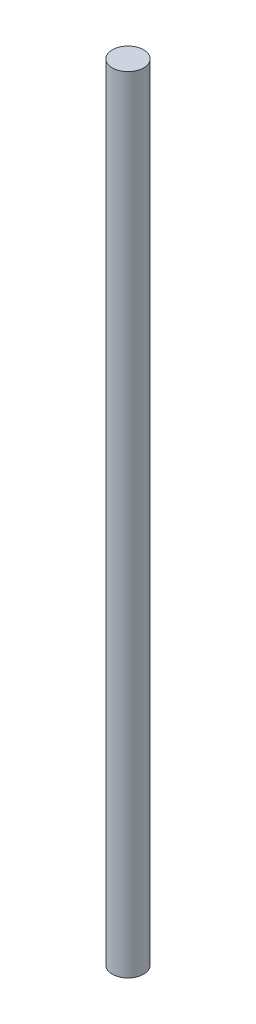
ISO-10303-21;
HEADER;
FILE_DESCRIPTION(('STEP AP214'),'2;1');
FILE_NAME('part.step','',(''),(''),'','','');
FILE_SCHEMA(('AUTOMOTIVE_DESIGN { 1 0 10303 214 1 1 1 1 }'));
ENDSEC;
DATA;
#1=APPLICATION_CONTEXT('core data for automotive mechanical design processes');
#2=APPLICATION_PROTOCOL_DEFINITION('international standard','automotive_design',2000,#1);
#3=PRODUCT_CONTEXT('',#1,'mechanical');
#4=PRODUCT('Part','Part','',(#3));
#5=PRODUCT_RELATED_PRODUCT_CATEGORY('part','',(#4));
#6=PRODUCT_DEFINITION_FORMATION('','',#4);
#7=PRODUCT_DEFINITION_CONTEXT('part definition',#1,'design');
#8=PRODUCT_DEFINITION('design','',#6,#7);
#9=PRODUCT_DEFINITION_SHAPE('','',#8);
#10=(LENGTH_UNIT() NAMED_UNIT(*) SI_UNIT(.MILLI.,.METRE.));
#11=(NAMED_UNIT(*) PLANE_ANGLE_UNIT() SI_UNIT($,.RADIAN.));
#12=(NAMED_UNIT(*) SI_UNIT($,.STERADIAN.) SOLID_ANGLE_UNIT());
#13=UNCERTAINTY_MEASURE_WITH_UNIT(LENGTH_MEASURE(1.E-05),#10,'distance_accuracy_value','');
#14=(GEOMETRIC_REPRESENTATION_CONTEXT(3) GLOBAL_UNCERTAINTY_ASSIGNED_CONTEXT((#13)) GLOBAL_UNIT_ASSIGNED_CONTEXT((#10,
#11,#12)) REPRESENTATION_CONTEXT('',''));
#15=CARTESIAN_POINT('',(0.,0.,0.));
#16=DIRECTION('',(0.,0.,1.));
#17=DIRECTION('',(1.,0.,0.));
#18=AXIS2_PLACEMENT_3D('',#15,#16,#17);
#19=CARTESIAN_POINT('',(0.,200.,0.));
#20=DIRECTION('',(0.,-1.,0.));
#21=DIRECTION('',(0.,0.,-1.));
#22=AXIS2_PLACEMENT_3D('',#19,#20,#21);
#23=CYLINDRICAL_SURFACE('',#22,4.);
#24=CARTESIAN_POINT('',(0.,200.,0.));
#25=DIRECTION('',(0.,1.,0.));
#26=DIRECTION('',(0.,0.,1.));
#27=AXIS2_PLACEMENT_3D('',#24,#25,#26);
#28=CIRCLE('',#27,4.);
#29=CARTESIAN_POINT('',(0.,200.,4.));
#30=VERTEX_POINT('',#29);
#31=EDGE_CURVE('E10',#30,#30,#28,.T.);
#32=ORIENTED_EDGE('',*,*,#31,.F.);
#33=EDGE_LOOP('',(#32));
#34=FACE_BOUND('',#33,.T.);
#35=CARTESIAN_POINT('',(0.,0.,0.));
#36=DIRECTION('',(0.,1.,0.));
#37=DIRECTION('',(0.,0.,1.));
#38=AXIS2_PLACEMENT_3D('',#35,#36,#37);
#39=CIRCLE('',#38,4.);
#40=CARTESIAN_POINT('',(0.,0.,4.));
#41=VERTEX_POINT('',#40);
#42=EDGE_CURVE('E34',#41,#41,#39,.T.);
#43=ORIENTED_EDGE('',*,*,#42,.T.);
#44=EDGE_LOOP('',(#43));
#45=FACE_BOUND('',#44,.T.);
#46=ADVANCED_FACE('F31',(#34,#45),#23,.T.);
#47=CARTESIAN_POINT('',(0.,200.,0.));
#48=DIRECTION('',(0.,1.,0.));
#49=DIRECTION('',(0.,0.,1.));
#50=AXIS2_PLACEMENT_3D('',#47,#48,#49);
#51=PLANE('',#50);
#52=ORIENTED_EDGE('',*,*,#31,.T.);
#53=EDGE_LOOP('',(#52));
#54=FACE_BOUND('',#53,.T.);
#55=ADVANCED_FACE('F46',(#54),#51,.T.);
#56=CARTESIAN_POINT('',(0.,0.,0.));
#57=DIRECTION('',(0.,1.,0.));
#58=DIRECTION('',(0.,0.,1.));
#59=AXIS2_PLACEMENT_3D('',#56,#57,#58);
#60=PLANE('',#59);
#61=ORIENTED_EDGE('',*,*,#42,.F.);
#62=EDGE_LOOP('',(#61));
#63=FACE_BOUND('',#62,.T.);
#64=ADVANCED_FACE('F44',(#63),#60,.F.);
#65=CLOSED_SHELL('',(#46,#55,#64));
#66=MANIFOLD_SOLID_BREP('B2',#65);
#67=ADVANCED_BREP_SHAPE_REPRESENTATION('',(#18,#66),#14);
#68=SHAPE_DEFINITION_REPRESENTATION(#9,#67);
ENDSEC;
END-ISO-10303-21;
